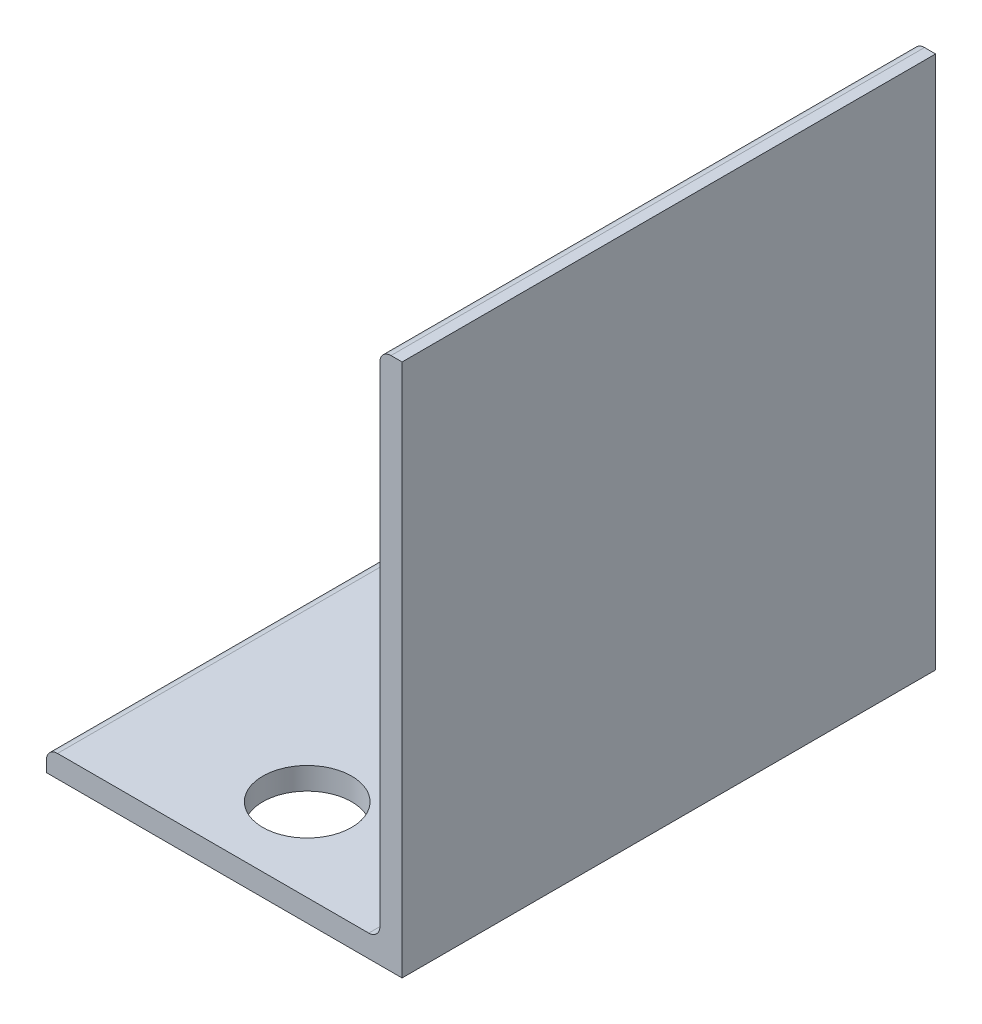
ISO-10303-21;
HEADER;
FILE_DESCRIPTION(('STEP AP214'),'2;1');
FILE_NAME('part.step','',(''),(''),'','','');
FILE_SCHEMA(('AUTOMOTIVE_DESIGN { 1 0 10303 214 1 1 1 1 }'));
ENDSEC;
DATA;
#1=APPLICATION_CONTEXT('core data for automotive mechanical design processes');
#2=APPLICATION_PROTOCOL_DEFINITION('international standard','automotive_design',2000,#1);
#3=PRODUCT_CONTEXT('',#1,'mechanical');
#4=PRODUCT('Part','Part','',(#3));
#5=PRODUCT_RELATED_PRODUCT_CATEGORY('part','',(#4));
#6=PRODUCT_DEFINITION_FORMATION('','',#4);
#7=PRODUCT_DEFINITION_CONTEXT('part definition',#1,'design');
#8=PRODUCT_DEFINITION('design','',#6,#7);
#9=PRODUCT_DEFINITION_SHAPE('','',#8);
#10=(LENGTH_UNIT() NAMED_UNIT(*) SI_UNIT(.MILLI.,.METRE.));
#11=(NAMED_UNIT(*) PLANE_ANGLE_UNIT() SI_UNIT($,.RADIAN.));
#12=(NAMED_UNIT(*) SI_UNIT($,.STERADIAN.) SOLID_ANGLE_UNIT());
#13=UNCERTAINTY_MEASURE_WITH_UNIT(LENGTH_MEASURE(1.E-05),#10,'distance_accuracy_value','');
#14=(GEOMETRIC_REPRESENTATION_CONTEXT(3) GLOBAL_UNCERTAINTY_ASSIGNED_CONTEXT((#13)) GLOBAL_UNIT_ASSIGNED_CONTEXT((#10,
#11,#12)) REPRESENTATION_CONTEXT('',''));
#15=CARTESIAN_POINT('',(0.,0.,0.));
#16=DIRECTION('',(0.,0.,1.));
#17=DIRECTION('',(1.,0.,0.));
#18=AXIS2_PLACEMENT_3D('',#15,#16,#17);
#19=CARTESIAN_POINT('',(-50.8,3.175,76.2));
#20=DIRECTION('',(1.,0.,0.));
#21=DIRECTION('',(0.,0.,-1.));
#22=AXIS2_PLACEMENT_3D('',#19,#20,#21);
#23=PLANE('',#22);
#24=DIRECTION('',(0.,-1.,0.));
#25=VECTOR('',#24,1.);
#26=CARTESIAN_POINT('',(-50.8,3.175,-76.2));
#27=LINE('',#26,#25);
#28=CARTESIAN_POINT('',(-50.8,3.175,-76.2));
#29=VERTEX_POINT('',#28);
#30=CARTESIAN_POINT('',(-50.8,0.,-76.2));
#31=VERTEX_POINT('',#30);
#32=EDGE_CURVE('E138',#29,#31,#27,.T.);
#33=ORIENTED_EDGE('',*,*,#32,.T.);
#34=DIRECTION('',(0.,0.,-1.));
#35=VECTOR('',#34,1.);
#36=CARTESIAN_POINT('',(-50.8,0.,76.2));
#37=LINE('',#36,#35);
#38=CARTESIAN_POINT('',(-50.8,0.,76.2));
#39=VERTEX_POINT('',#38);
#40=EDGE_CURVE('E11',#39,#31,#37,.T.);
#41=ORIENTED_EDGE('',*,*,#40,.F.);
#42=DIRECTION('',(0.,-1.,0.));
#43=VECTOR('',#42,1.);
#44=CARTESIAN_POINT('',(-50.8,3.175,76.2));
#45=LINE('',#44,#43);
#46=CARTESIAN_POINT('',(-50.8,3.175,76.2));
#47=VERTEX_POINT('',#46);
#48=EDGE_CURVE('E155',#47,#39,#45,.T.);
#49=ORIENTED_EDGE('',*,*,#48,.F.);
#50=DIRECTION('',(0.,0.,-1.));
#51=VECTOR('',#50,1.);
#52=CARTESIAN_POINT('',(-50.8,3.175,76.2));
#53=LINE('',#52,#51);
#54=EDGE_CURVE('E134',#47,#29,#53,.T.);
#55=ORIENTED_EDGE('',*,*,#54,.T.);
#56=EDGE_LOOP('',(#33,#41,#49,#55));
#57=FACE_BOUND('',#56,.T.);
#58=ADVANCED_FACE('F36',(#57),#23,.F.);
#59=CARTESIAN_POINT('',(-50.8,0.,76.2));
#60=DIRECTION('',(0.,1.,0.));
#61=DIRECTION('',(0.,0.,1.));
#62=AXIS2_PLACEMENT_3D('',#59,#60,#61);
#63=PLANE('',#62);
#64=CARTESIAN_POINT('',(0.,0.,-52.5));
#65=DIRECTION('',(0.,1.,0.));
#66=DIRECTION('',(-1.,0.,0.));
#67=AXIS2_PLACEMENT_3D('',#64,#65,#66);
#68=CIRCLE('',#67,12.7);
#69=CARTESIAN_POINT('',(-12.7,0.,-52.5));
#70=VERTEX_POINT('',#69);
#71=EDGE_CURVE('E142',#70,#70,#68,.T.);
#72=ORIENTED_EDGE('',*,*,#71,.T.);
#73=EDGE_LOOP('',(#72));
#74=FACE_BOUND('',#73,.T.);
#75=CARTESIAN_POINT('',(0.,0.,52.5));
#76=DIRECTION('',(0.,1.,0.));
#77=DIRECTION('',(1.,0.,0.));
#78=AXIS2_PLACEMENT_3D('',#75,#76,#77);
#79=CIRCLE('',#78,12.7);
#80=CARTESIAN_POINT('',(12.7,0.,52.5));
#81=VERTEX_POINT('',#80);
#82=EDGE_CURVE('E205',#81,#81,#79,.T.);
#83=ORIENTED_EDGE('',*,*,#82,.T.);
#84=EDGE_LOOP('',(#83));
#85=FACE_BOUND('',#84,.T.);
#86=CARTESIAN_POINT('',(0.,0.,0.));
#87=DIRECTION('',(0.,1.,0.));
#88=DIRECTION('',(-1.,0.,0.));
#89=AXIS2_PLACEMENT_3D('',#86,#87,#88);
#90=CIRCLE('',#89,10.);
#91=CARTESIAN_POINT('',(-10.,0.,0.));
#92=VERTEX_POINT('',#91);
#93=EDGE_CURVE('E199',#92,#92,#90,.T.);
#94=ORIENTED_EDGE('',*,*,#93,.T.);
#95=EDGE_LOOP('',(#94));
#96=FACE_BOUND('',#95,.T.);
#97=DIRECTION('',(1.,0.,0.));
#98=VECTOR('',#97,1.);
#99=CARTESIAN_POINT('',(-50.8,0.,-76.2));
#100=LINE('',#99,#98);
#101=CARTESIAN_POINT('',(50.8,0.,-76.2));
#102=VERTEX_POINT('',#101);
#103=EDGE_CURVE('E141',#31,#102,#100,.T.);
#104=ORIENTED_EDGE('',*,*,#103,.T.);
#105=DIRECTION('',(0.,0.,-1.));
#106=VECTOR('',#105,1.);
#107=CARTESIAN_POINT('',(50.8,0.,76.2));
#108=LINE('',#107,#106);
#109=CARTESIAN_POINT('',(50.8,0.,76.2));
#110=VERTEX_POINT('',#109);
#111=EDGE_CURVE('E44',#110,#102,#108,.T.);
#112=ORIENTED_EDGE('',*,*,#111,.F.);
#113=DIRECTION('',(1.,0.,0.));
#114=VECTOR('',#113,1.);
#115=CARTESIAN_POINT('',(-50.8,0.,76.2));
#116=LINE('',#115,#114);
#117=EDGE_CURVE('E98',#39,#110,#116,.T.);
#118=ORIENTED_EDGE('',*,*,#117,.F.);
#119=ORIENTED_EDGE('',*,*,#40,.T.);
#120=EDGE_LOOP('',(#104,#112,#118,#119));
#121=FACE_BOUND('',#120,.T.);
#122=ADVANCED_FACE('F214',(#74,#85,#96,#121),#63,.F.);
#123=CARTESIAN_POINT('',(50.8,0.,76.2));
#124=DIRECTION('',(-1.,0.,0.));
#125=DIRECTION('',(0.,0.,1.));
#126=AXIS2_PLACEMENT_3D('',#123,#124,#125);
#127=PLANE('',#126);
#128=DIRECTION('',(0.,1.,0.));
#129=VECTOR('',#128,1.);
#130=CARTESIAN_POINT('',(50.8,0.,-76.2));
#131=LINE('',#130,#129);
#132=CARTESIAN_POINT('',(50.8,152.4,-76.2));
#133=VERTEX_POINT('',#132);
#134=EDGE_CURVE('E144',#102,#133,#131,.T.);
#135=ORIENTED_EDGE('',*,*,#134,.T.);
#136=DIRECTION('',(0.,0.,-1.));
#137=VECTOR('',#136,1.);
#138=CARTESIAN_POINT('',(50.8,152.4,76.2));
#139=LINE('',#138,#137);
#140=CARTESIAN_POINT('',(50.8,152.4,76.2));
#141=VERTEX_POINT('',#140);
#142=EDGE_CURVE('E165',#141,#133,#139,.T.);
#143=ORIENTED_EDGE('',*,*,#142,.F.);
#144=DIRECTION('',(0.,1.,0.));
#145=VECTOR('',#144,1.);
#146=CARTESIAN_POINT('',(50.8,0.,76.2));
#147=LINE('',#146,#145);
#148=EDGE_CURVE('E173',#110,#141,#147,.T.);
#149=ORIENTED_EDGE('',*,*,#148,.F.);
#150=ORIENTED_EDGE('',*,*,#111,.T.);
#151=EDGE_LOOP('',(#135,#143,#149,#150));
#152=FACE_BOUND('',#151,.T.);
#153=ADVANCED_FACE('F171',(#152),#127,.F.);
#154=CARTESIAN_POINT('',(47.625,152.4,76.2));
#155=DIRECTION('',(0.,-1.,0.));
#156=DIRECTION('',(1.,0.,0.));
#157=AXIS2_PLACEMENT_3D('',#154,#155,#156);
#158=PLANE('',#157);
#159=DIRECTION('',(-1.,0.,0.));
#160=VECTOR('',#159,1.);
#161=CARTESIAN_POINT('',(47.625,152.4,-76.2));
#162=LINE('',#161,#160);
#163=CARTESIAN_POINT('',(47.625,152.4,-76.2));
#164=VERTEX_POINT('',#163);
#165=EDGE_CURVE('E146',#133,#164,#162,.T.);
#166=ORIENTED_EDGE('',*,*,#165,.T.);
#167=DIRECTION('',(0.,0.,-1.));
#168=VECTOR('',#167,1.);
#169=CARTESIAN_POINT('',(47.625,152.4,76.2));
#170=LINE('',#169,#168);
#171=CARTESIAN_POINT('',(47.625,152.4,76.2));
#172=VERTEX_POINT('',#171);
#173=EDGE_CURVE('E162',#172,#164,#170,.T.);
#174=ORIENTED_EDGE('',*,*,#173,.F.);
#175=DIRECTION('',(-1.,0.,0.));
#176=VECTOR('',#175,1.);
#177=CARTESIAN_POINT('',(47.625,152.4,76.2));
#178=LINE('',#177,#176);
#179=EDGE_CURVE('E189',#141,#172,#178,.T.);
#180=ORIENTED_EDGE('',*,*,#179,.F.);
#181=ORIENTED_EDGE('',*,*,#142,.T.);
#182=EDGE_LOOP('',(#166,#174,#180,#181));
#183=FACE_BOUND('',#182,.T.);
#184=ADVANCED_FACE('F182',(#183),#158,.F.);
#185=CARTESIAN_POINT('',(47.625,149.225,76.2));
#186=DIRECTION('',(0.,0.,-1.));
#187=DIRECTION('',(-1.,0.,0.));
#188=AXIS2_PLACEMENT_3D('',#185,#186,#187);
#189=CYLINDRICAL_SURFACE('',#188,3.175);
#190=CARTESIAN_POINT('',(47.625,149.225,-76.2));
#191=DIRECTION('',(0.,0.,1.));
#192=DIRECTION('',(-1.,0.,0.));
#193=AXIS2_PLACEMENT_3D('',#190,#191,#192);
#194=CIRCLE('',#193,3.175);
#195=CARTESIAN_POINT('',(44.45,149.225,-76.2));
#196=VERTEX_POINT('',#195);
#197=EDGE_CURVE('E148',#164,#196,#194,.T.);
#198=ORIENTED_EDGE('',*,*,#197,.T.);
#199=DIRECTION('',(0.,0.,-1.));
#200=VECTOR('',#199,1.);
#201=CARTESIAN_POINT('',(44.45,149.225,76.2));
#202=LINE('',#201,#200);
#203=CARTESIAN_POINT('',(44.45,149.225,76.2));
#204=VERTEX_POINT('',#203);
#205=EDGE_CURVE('E159',#204,#196,#202,.T.);
#206=ORIENTED_EDGE('',*,*,#205,.F.);
#207=CARTESIAN_POINT('',(47.625,149.225,76.2));
#208=DIRECTION('',(0.,0.,1.));
#209=DIRECTION('',(-1.,0.,0.));
#210=AXIS2_PLACEMENT_3D('',#207,#208,#209);
#211=CIRCLE('',#210,3.175);
#212=EDGE_CURVE('E188',#172,#204,#211,.T.);
#213=ORIENTED_EDGE('',*,*,#212,.F.);
#214=ORIENTED_EDGE('',*,*,#173,.T.);
#215=EDGE_LOOP('',(#198,#206,#213,#214));
#216=FACE_BOUND('',#215,.T.);
#217=ADVANCED_FACE('F186',(#216),#189,.T.);
#218=CARTESIAN_POINT('',(44.45,149.225,76.2));
#219=DIRECTION('',(1.,0.,0.));
#220=DIRECTION('',(0.,1.,0.));
#221=AXIS2_PLACEMENT_3D('',#218,#219,#220);
#222=PLANE('',#221);
#223=DIRECTION('',(0.,-1.,0.));
#224=VECTOR('',#223,1.);
#225=CARTESIAN_POINT('',(44.45,149.225,-76.2));
#226=LINE('',#225,#224);
#227=CARTESIAN_POINT('',(44.45,9.525,-76.2));
#228=VERTEX_POINT('',#227);
#229=EDGE_CURVE('E150',#196,#228,#226,.T.);
#230=ORIENTED_EDGE('',*,*,#229,.T.);
#231=DIRECTION('',(0.,0.,-1.));
#232=VECTOR('',#231,1.);
#233=CARTESIAN_POINT('',(44.45,9.525,76.2));
#234=LINE('',#233,#232);
#235=CARTESIAN_POINT('',(44.45,9.525,76.2));
#236=VERTEX_POINT('',#235);
#237=EDGE_CURVE('E129',#236,#228,#234,.T.);
#238=ORIENTED_EDGE('',*,*,#237,.F.);
#239=DIRECTION('',(0.,-1.,0.));
#240=VECTOR('',#239,1.);
#241=CARTESIAN_POINT('',(44.45,149.225,76.2));
#242=LINE('',#241,#240);
#243=EDGE_CURVE('E120',#204,#236,#242,.T.);
#244=ORIENTED_EDGE('',*,*,#243,.F.);
#245=ORIENTED_EDGE('',*,*,#205,.T.);
#246=EDGE_LOOP('',(#230,#238,#244,#245));
#247=FACE_BOUND('',#246,.T.);
#248=ADVANCED_FACE('F253',(#247),#222,.F.);
#249=CARTESIAN_POINT('',(41.275,9.52500000000001,76.2));
#250=DIRECTION('',(0.,0.,-1.));
#251=DIRECTION('',(-1.,0.,0.));
#252=AXIS2_PLACEMENT_3D('',#249,#250,#251);
#253=CYLINDRICAL_SURFACE('',#252,3.175);
#254=CARTESIAN_POINT('',(41.275,9.52500000000001,-76.2));
#255=DIRECTION('',(0.,0.,-1.));
#256=DIRECTION('',(-1.,0.,0.));
#257=AXIS2_PLACEMENT_3D('',#254,#255,#256);
#258=CIRCLE('',#257,3.175);
#259=CARTESIAN_POINT('',(41.275,6.35000000000001,-76.2));
#260=VERTEX_POINT('',#259);
#261=EDGE_CURVE('E128',#228,#260,#258,.T.);
#262=ORIENTED_EDGE('',*,*,#261,.T.);
#263=DIRECTION('',(0.,0.,-1.));
#264=VECTOR('',#263,1.);
#265=CARTESIAN_POINT('',(41.275,6.35000000000001,76.2));
#266=LINE('',#265,#264);
#267=CARTESIAN_POINT('',(41.275,6.35000000000001,76.2));
#268=VERTEX_POINT('',#267);
#269=EDGE_CURVE('E125',#268,#260,#266,.T.);
#270=ORIENTED_EDGE('',*,*,#269,.F.);
#271=CARTESIAN_POINT('',(41.275,9.52500000000001,76.2));
#272=DIRECTION('',(0.,0.,-1.));
#273=DIRECTION('',(-1.,0.,0.));
#274=AXIS2_PLACEMENT_3D('',#271,#272,#273);
#275=CIRCLE('',#274,3.175);
#276=EDGE_CURVE('E114',#236,#268,#275,.T.);
#277=ORIENTED_EDGE('',*,*,#276,.F.);
#278=ORIENTED_EDGE('',*,*,#237,.T.);
#279=EDGE_LOOP('',(#262,#270,#277,#278));
#280=FACE_BOUND('',#279,.T.);
#281=ADVANCED_FACE('F126',(#280),#253,.F.);
#282=CARTESIAN_POINT('',(41.275,6.35,76.2));
#283=DIRECTION('',(0.,-1.,0.));
#284=DIRECTION('',(1.,0.,0.));
#285=AXIS2_PLACEMENT_3D('',#282,#283,#284);
#286=PLANE('',#285);
#287=CARTESIAN_POINT('',(0.,6.35,-52.5));
#288=DIRECTION('',(0.,1.,0.));
#289=DIRECTION('',(-1.,0.,0.));
#290=AXIS2_PLACEMENT_3D('',#287,#288,#289);
#291=CIRCLE('',#290,12.7);
#292=CARTESIAN_POINT('',(-12.7,6.34999999999999,-52.5));
#293=VERTEX_POINT('',#292);
#294=EDGE_CURVE('E208',#293,#293,#291,.T.);
#295=ORIENTED_EDGE('',*,*,#294,.F.);
#296=EDGE_LOOP('',(#295));
#297=FACE_BOUND('',#296,.T.);
#298=CARTESIAN_POINT('',(0.,6.35,52.5));
#299=DIRECTION('',(0.,1.,0.));
#300=DIRECTION('',(1.,0.,0.));
#301=AXIS2_PLACEMENT_3D('',#298,#299,#300);
#302=CIRCLE('',#301,12.7);
#303=CARTESIAN_POINT('',(12.7,6.35,52.5));
#304=VERTEX_POINT('',#303);
#305=EDGE_CURVE('E202',#304,#304,#302,.T.);
#306=ORIENTED_EDGE('',*,*,#305,.F.);
#307=EDGE_LOOP('',(#306));
#308=FACE_BOUND('',#307,.T.);
#309=CARTESIAN_POINT('',(0.,6.35,0.));
#310=DIRECTION('',(0.,1.,0.));
#311=DIRECTION('',(-1.,0.,0.));
#312=AXIS2_PLACEMENT_3D('',#309,#310,#311);
#313=CIRCLE('',#312,10.);
#314=CARTESIAN_POINT('',(-10.,6.35,0.));
#315=VERTEX_POINT('',#314);
#316=EDGE_CURVE('E196',#315,#315,#313,.T.);
#317=ORIENTED_EDGE('',*,*,#316,.F.);
#318=EDGE_LOOP('',(#317));
#319=FACE_BOUND('',#318,.T.);
#320=DIRECTION('',(-1.,0.,0.));
#321=VECTOR('',#320,1.);
#322=CARTESIAN_POINT('',(41.275,6.35,-76.2));
#323=LINE('',#322,#321);
#324=CARTESIAN_POINT('',(-47.625,6.34999999999999,-76.2));
#325=VERTEX_POINT('',#324);
#326=EDGE_CURVE('E84',#260,#325,#323,.T.);
#327=ORIENTED_EDGE('',*,*,#326,.T.);
#328=DIRECTION('',(0.,0.,-1.));
#329=VECTOR('',#328,1.);
#330=CARTESIAN_POINT('',(-47.625,6.34999999999999,76.2));
#331=LINE('',#330,#329);
#332=CARTESIAN_POINT('',(-47.625,6.34999999999999,76.2));
#333=VERTEX_POINT('',#332);
#334=EDGE_CURVE('E130',#333,#325,#331,.T.);
#335=ORIENTED_EDGE('',*,*,#334,.F.);
#336=DIRECTION('',(-1.,0.,0.));
#337=VECTOR('',#336,1.);
#338=CARTESIAN_POINT('',(41.275,6.35,76.2));
#339=LINE('',#338,#337);
#340=EDGE_CURVE('E118',#268,#333,#339,.T.);
#341=ORIENTED_EDGE('',*,*,#340,.F.);
#342=ORIENTED_EDGE('',*,*,#269,.T.);
#343=EDGE_LOOP('',(#327,#335,#341,#342));
#344=FACE_BOUND('',#343,.T.);
#345=ADVANCED_FACE('F132',(#297,#308,#319,#344),#286,.F.);
#346=CARTESIAN_POINT('',(-47.625,3.175,76.2));
#347=DIRECTION('',(0.,0.,-1.));
#348=DIRECTION('',(-1.,0.,0.));
#349=AXIS2_PLACEMENT_3D('',#346,#347,#348);
#350=CYLINDRICAL_SURFACE('',#349,3.175);
#351=CARTESIAN_POINT('',(-47.625,3.175,-76.2));
#352=DIRECTION('',(0.,0.,1.));
#353=DIRECTION('',(-1.,0.,0.));
#354=AXIS2_PLACEMENT_3D('',#351,#352,#353);
#355=CIRCLE('',#354,3.175);
#356=EDGE_CURVE('E90',#325,#29,#355,.T.);
#357=ORIENTED_EDGE('',*,*,#356,.T.);
#358=ORIENTED_EDGE('',*,*,#54,.F.);
#359=CARTESIAN_POINT('',(-47.625,3.175,76.2));
#360=DIRECTION('',(0.,0.,1.));
#361=DIRECTION('',(-1.,0.,0.));
#362=AXIS2_PLACEMENT_3D('',#359,#360,#361);
#363=CIRCLE('',#362,3.175);
#364=EDGE_CURVE('E52',#333,#47,#363,.T.);
#365=ORIENTED_EDGE('',*,*,#364,.F.);
#366=ORIENTED_EDGE('',*,*,#334,.T.);
#367=EDGE_LOOP('',(#357,#358,#365,#366));
#368=FACE_BOUND('',#367,.T.);
#369=ADVANCED_FACE('F226',(#368),#350,.T.);
#370=CARTESIAN_POINT('',(47.625,149.225,76.2));
#371=DIRECTION('',(0.,0.,-1.));
#372=DIRECTION('',(-1.,0.,0.));
#373=AXIS2_PLACEMENT_3D('',#370,#371,#372);
#374=PLANE('',#373);
#375=ORIENTED_EDGE('',*,*,#48,.T.);
#376=ORIENTED_EDGE('',*,*,#117,.T.);
#377=ORIENTED_EDGE('',*,*,#148,.T.);
#378=ORIENTED_EDGE('',*,*,#179,.T.);
#379=ORIENTED_EDGE('',*,*,#212,.T.);
#380=ORIENTED_EDGE('',*,*,#243,.T.);
#381=ORIENTED_EDGE('',*,*,#276,.T.);
#382=ORIENTED_EDGE('',*,*,#340,.T.);
#383=ORIENTED_EDGE('',*,*,#364,.T.);
#384=EDGE_LOOP('',(#375,#376,#377,#378,#379,#380,#381,#382,#383));
#385=FACE_BOUND('',#384,.T.);
#386=ADVANCED_FACE('F116',(#385),#374,.F.);
#387=CARTESIAN_POINT('',(47.625,149.225,-76.2));
#388=DIRECTION('',(0.,0.,-1.));
#389=DIRECTION('',(-1.,0.,0.));
#390=AXIS2_PLACEMENT_3D('',#387,#388,#389);
#391=PLANE('',#390);
#392=ORIENTED_EDGE('',*,*,#32,.F.);
#393=ORIENTED_EDGE('',*,*,#356,.F.);
#394=ORIENTED_EDGE('',*,*,#326,.F.);
#395=ORIENTED_EDGE('',*,*,#261,.F.);
#396=ORIENTED_EDGE('',*,*,#229,.F.);
#397=ORIENTED_EDGE('',*,*,#197,.F.);
#398=ORIENTED_EDGE('',*,*,#165,.F.);
#399=ORIENTED_EDGE('',*,*,#134,.F.);
#400=ORIENTED_EDGE('',*,*,#103,.F.);
#401=EDGE_LOOP('',(#392,#393,#394,#395,#396,#397,#398,#399,#400));
#402=FACE_BOUND('',#401,.T.);
#403=ADVANCED_FACE('F177',(#402),#391,.T.);
#404=CARTESIAN_POINT('',(0.,0.,0.));
#405=DIRECTION('',(0.,1.,0.));
#406=DIRECTION('',(-1.,0.,0.));
#407=AXIS2_PLACEMENT_3D('',#404,#405,#406);
#408=CYLINDRICAL_SURFACE('',#407,10.);
#409=ORIENTED_EDGE('',*,*,#93,.F.);
#410=EDGE_LOOP('',(#409));
#411=FACE_BOUND('',#410,.T.);
#412=ORIENTED_EDGE('',*,*,#316,.T.);
#413=EDGE_LOOP('',(#412));
#414=FACE_BOUND('',#413,.T.);
#415=ADVANCED_FACE('F232',(#411,#414),#408,.F.);
#416=CARTESIAN_POINT('',(0.,0.,52.5));
#417=DIRECTION('',(0.,1.,0.));
#418=DIRECTION('',(-1.,0.,0.));
#419=AXIS2_PLACEMENT_3D('',#416,#417,#418);
#420=CYLINDRICAL_SURFACE('',#419,12.7);
#421=ORIENTED_EDGE('',*,*,#82,.F.);
#422=EDGE_LOOP('',(#421));
#423=FACE_BOUND('',#422,.T.);
#424=ORIENTED_EDGE('',*,*,#305,.T.);
#425=EDGE_LOOP('',(#424));
#426=FACE_BOUND('',#425,.T.);
#427=ADVANCED_FACE('F220',(#423,#426),#420,.F.);
#428=CARTESIAN_POINT('',(0.,0.,-52.5));
#429=DIRECTION('',(0.,1.,0.));
#430=DIRECTION('',(-1.,0.,0.));
#431=AXIS2_PLACEMENT_3D('',#428,#429,#430);
#432=CYLINDRICAL_SURFACE('',#431,12.7);
#433=ORIENTED_EDGE('',*,*,#71,.F.);
#434=EDGE_LOOP('',(#433));
#435=FACE_BOUND('',#434,.T.);
#436=ORIENTED_EDGE('',*,*,#294,.T.);
#437=EDGE_LOOP('',(#436));
#438=FACE_BOUND('',#437,.T.);
#439=ADVANCED_FACE('F217',(#435,#438),#432,.F.);
#440=CLOSED_SHELL('',(#58,#122,#153,#184,#217,#248,#281,#345,#369,#386,#403,#415,#427,#439));
#441=MANIFOLD_SOLID_BREP('B2',#440);
#442=ADVANCED_BREP_SHAPE_REPRESENTATION('',(#18,#441),#14);
#443=SHAPE_DEFINITION_REPRESENTATION(#9,#442);
ENDSEC;
END-ISO-10303-21;
